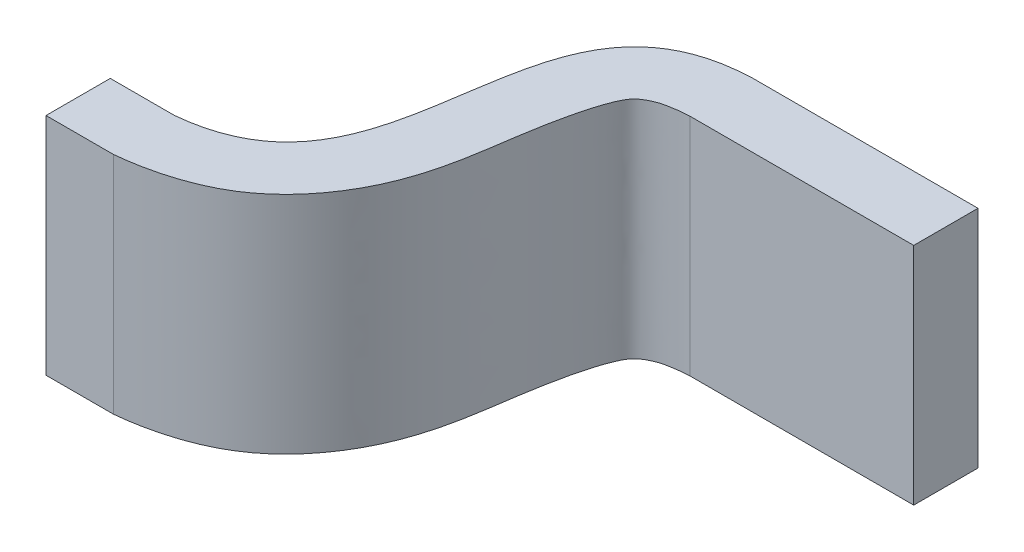
ISO-10303-21;
HEADER;
FILE_DESCRIPTION(('STEP AP214'),'2;1');
FILE_NAME('part.step','',(''),(''),'','','');
FILE_SCHEMA(('AUTOMOTIVE_DESIGN { 1 0 10303 214 1 1 1 1 }'));
ENDSEC;
DATA;
#1=APPLICATION_CONTEXT('core data for automotive mechanical design processes');
#2=APPLICATION_PROTOCOL_DEFINITION('international standard','automotive_design',2000,#1);
#3=PRODUCT_CONTEXT('',#1,'mechanical');
#4=PRODUCT('Part','Part','',(#3));
#5=PRODUCT_RELATED_PRODUCT_CATEGORY('part','',(#4));
#6=PRODUCT_DEFINITION_FORMATION('','',#4);
#7=PRODUCT_DEFINITION_CONTEXT('part definition',#1,'design');
#8=PRODUCT_DEFINITION('design','',#6,#7);
#9=PRODUCT_DEFINITION_SHAPE('','',#8);
#10=(LENGTH_UNIT() NAMED_UNIT(*) SI_UNIT(.MILLI.,.METRE.));
#11=(NAMED_UNIT(*) PLANE_ANGLE_UNIT() SI_UNIT($,.RADIAN.));
#12=(NAMED_UNIT(*) SI_UNIT($,.STERADIAN.) SOLID_ANGLE_UNIT());
#13=UNCERTAINTY_MEASURE_WITH_UNIT(LENGTH_MEASURE(1.E-05),#10,'distance_accuracy_value','');
#14=(GEOMETRIC_REPRESENTATION_CONTEXT(3) GLOBAL_UNCERTAINTY_ASSIGNED_CONTEXT((#13)) GLOBAL_UNIT_ASSIGNED_CONTEXT((#10,
#11,#12)) REPRESENTATION_CONTEXT('',''));
#15=CARTESIAN_POINT('',(0.,0.,0.));
#16=DIRECTION('',(0.,0.,1.));
#17=DIRECTION('',(1.,0.,0.));
#18=AXIS2_PLACEMENT_3D('',#15,#16,#17);
#19=CARTESIAN_POINT('',(0.381062000989914,-1.47687603414217,1.19999994098963));
#20=DIRECTION('',(0.,1.,4.37113882867379E-08));
#21=DIRECTION('',(-1.,0.,0.));
#22=AXIS2_PLACEMENT_3D('',#19,#20,#21);
#23=PLANE('',#22);
#24=DIRECTION('',(1.,0.,0.));
#25=VECTOR('',#24,1.);
#26=CARTESIAN_POINT('',(8.21956578272591,-1.47687599043078,0.199999940989626));
#27=LINE('',#26,#25);
#28=CARTESIAN_POINT('',(8.21956578272591,-1.47687599043078,0.199999940989626));
#29=VERTEX_POINT('',#28);
#30=CARTESIAN_POINT('',(8.91606200098991,-1.47687599043078,0.199999940989626));
#31=VERTEX_POINT('',#30);
#32=EDGE_CURVE('E11',#29,#31,#27,.T.);
#33=ORIENTED_EDGE('',*,*,#32,.F.);
#34=CARTESIAN_POINT('',(8.21956578272591,-1.47687599043078,0.199999940989626));
#35=CARTESIAN_POINT('',(8.21399807265753,-1.47687599044051,0.200222602099352));
#36=CARTESIAN_POINT('',(8.20843683975348,-1.47687599045581,0.200572467057035));
#37=CARTESIAN_POINT('',(8.19732835868844,-1.47687599049638,0.201500599557958));
#38=CARTESIAN_POINT('',(8.19178112714533,-1.47687599052166,0.20207906786945));
#39=CARTESIAN_POINT('',(8.18066889231238,-1.47687599058129,0.203443147589109));
#40=CARTESIAN_POINT('',(8.17510408096633,-1.4768759906157,0.204230319381954));
#41=CARTESIAN_POINT('',(8.16401243640824,-1.47687599069444,0.206031850609965));
#42=CARTESIAN_POINT('',(8.15848559635561,-1.47687599073878,0.20704616795629));
#43=CARTESIAN_POINT('',(8.1465743503038,-1.4768759908516,0.209627265093131));
#44=CARTESIAN_POINT('',(8.14020246940725,-1.4768759909229,0.211258358150453));
#45=CARTESIAN_POINT('',(8.12921644404484,-1.47687599108147,0.214886107390859));
#46=CARTESIAN_POINT('',(8.12454576276441,-1.47687599116087,0.216702585725697));
#47=CARTESIAN_POINT('',(8.11575076349414,-1.47687599133748,0.220742965728565));
#48=CARTESIAN_POINT('',(8.11161057174428,-1.47687599143324,0.222933854437322));
#49=CARTESIAN_POINT('',(8.10253183379761,-1.4768759916593,0.228105114025311));
#50=CARTESIAN_POINT('',(8.09762635625911,-1.47687599179248,0.231151620713566));
#51=CARTESIAN_POINT('',(8.09022405842899,-1.47687599204946,0.237031319573504));
#52=CARTESIAN_POINT('',(8.08749164440591,-1.4768759921597,0.239554011267641));
#53=CARTESIAN_POINT('',(8.08246087272025,-1.47687599239796,0.245002656510496));
#54=CARTESIAN_POINT('',(8.08016330387861,-1.47687599252601,0.247929326572815));
#55=CARTESIAN_POINT('',(8.0759951087917,-1.47687599278959,0.25396046141144));
#56=CARTESIAN_POINT('',(8.07411551519148,-1.47687599292487,0.257058928893297));
#57=CARTESIAN_POINT('',(8.0706064493533,-1.47687599320181,0.263392808416962));
#58=CARTESIAN_POINT('',(8.06897710136162,-1.47687599334349,0.266628287474188));
#59=CARTESIAN_POINT('',(8.06367328775614,-1.4768759938347,0.277849786579691));
#60=CARTESIAN_POINT('',(8.06040085858409,-1.47687599419218,0.286021972777192));
#61=CARTESIAN_POINT('',(8.05218527798451,-1.47687599517134,0.308422084191393));
#62=CARTESIAN_POINT('',(8.04771455008864,-1.47687599579965,0.322813177466201));
#63=CARTESIAN_POINT('',(8.03961753260656,-1.47687599705163,0.35146984270726));
#64=CARTESIAN_POINT('',(8.03597437543715,-1.47687599767508,0.365730846318128));
#65=CARTESIAN_POINT('',(8.02919339350917,-1.47687599892665,0.394362061181507));
#66=CARTESIAN_POINT('',(8.02605527280588,-1.47687599955476,0.40873220327195));
#67=CARTESIAN_POINT('',(8.01736410075411,-1.47687600140841,0.451139464717596));
#68=CARTESIAN_POINT('',(8.01232518312451,-1.47687600263861,0.479282677822178));
#69=CARTESIAN_POINT('',(8.00335647907099,-1.47687600510956,0.535811116286048));
#70=CARTESIAN_POINT('',(7.99942969347175,-1.47687600635033,0.564196787472043));
#71=CARTESIAN_POINT('',(7.99170167000416,-1.4768760086029,0.615729708611764));
#72=CARTESIAN_POINT('',(7.98800715437185,-1.47687600961536,0.638892051638554));
#73=CARTESIAN_POINT('',(7.9794355355205,-1.47687601163106,0.685005751083));
#74=CARTESIAN_POINT('',(7.97455858675596,-1.4768760126343,0.707957134651015));
#75=CARTESIAN_POINT('',(7.96311271686074,-1.47687601461767,0.753331539683628));
#76=CARTESIAN_POINT('',(7.95655194608926,-1.4768760155979,0.775756553644199));
#77=CARTESIAN_POINT('',(7.94136784202336,-1.47687601752719,0.819893592793445));
#78=CARTESIAN_POINT('',(7.93274558328641,-1.47687601847626,0.841605982756187));
#79=CARTESIAN_POINT('',(7.91043792110495,-1.47687602059855,0.890158317257777));
#80=CARTESIAN_POINT('',(7.89600936729223,-1.4768760217571,0.916662583594959));
#81=CARTESIAN_POINT('',(7.86347434987592,-1.47687602397549,0.967413343835515));
#82=CARTESIAN_POINT('',(7.8453597746674,-1.4768760250351,0.991654683188966));
#83=CARTESIAN_POINT('',(7.80790002602411,-1.47687602689358,1.0341715470258));
#84=CARTESIAN_POINT('',(7.78897432705133,-1.47687602770847,1.05281409028392));
#85=CARTESIAN_POINT('',(7.74844565833539,-1.47687602919522,1.08682689740164));
#86=CARTESIAN_POINT('',(7.72685155874366,-1.47687602986752,1.10220756450256));
#87=CARTESIAN_POINT('',(7.68359472899702,-1.47687603098652,1.12780720142861));
#88=CARTESIAN_POINT('',(7.66213857495581,-1.4768760314487,1.13838045617139));
#89=CARTESIAN_POINT('',(7.61806563506122,-1.4768760322593,1.1569248347623));
#90=CARTESIAN_POINT('',(7.59544469766516,-1.47687603260727,1.16488578060009));
#91=CARTESIAN_POINT('',(7.54848495398505,-1.47687603321614,1.17881501865543));
#92=CARTESIAN_POINT('',(7.52411482818412,-1.47687603347234,1.18467606433587));
#93=CARTESIAN_POINT('',(7.47514110847119,-1.47687603388116,1.19402859653764));
#94=CARTESIAN_POINT('',(7.4505414125435,-1.47687603403466,1.19754033118794));
#95=CARTESIAN_POINT('',(7.42586117783791,-1.47687603414216,1.19999994098963));
#96=B_SPLINE_CURVE_WITH_KNOTS('',3,(#34,#35,#36,#37,#38,#39,#40,#41,#42,#43,#44,#45,#46,#47,#48,
#49,#50,#51,#52,#53,#54,#55,#56,#57,#58,#59,#60,#61,#62,#63,#64,#65,#66,#67,#68,#69,#70,#71,#72,
#73,#74,#75,#76,#77,#78,#79,#80,#81,#82,#83,#84,#85,#86,#87,#88,#89,#90,#91,#92,#93,#94,#95),
.UNSPECIFIED.,.F.,.F.,(4,2,2,2,2,2,2,2,2,2,2,2,2,2,2,2,2,2,2,2,2,2,2,2,2,2,2,2,2,2,4),(0.,
0.0167129049826574,0.0334405206169266,0.0502969119078462,0.0671501823813333,0.0868449977925689,
0.101838970321101,0.115885127156847,0.133132127804882,0.144236213112224,0.155360252414285,
0.166215762863007,0.177076645740437,0.203446553112076,0.248618617741089,0.292765096579111,
0.336885611219412,0.422622380023037,0.508588331833532,0.578941414817067,0.649285312924715,
0.719294937731861,0.789268149044623,0.879502218060835,0.969937050040231,1.04934324822106,
1.12849225200604,1.200024637838,1.27183250557101,1.34691026454656,1.42133231106535),.UNSPECIFIED.);
#97=CARTESIAN_POINT('',(7.42586117783791,-1.47687603414217,1.19999994098963));
#98=VERTEX_POINT('',#97);
#99=EDGE_CURVE('E186',#29,#98,#96,.T.);
#100=ORIENTED_EDGE('',*,*,#99,.T.);
#101=DIRECTION('',(1.,0.,0.));
#102=VECTOR('',#101,1.);
#103=CARTESIAN_POINT('',(7.21606200098991,-1.47687603414217,1.19999994098963));
#104=LINE('',#103,#102);
#105=CARTESIAN_POINT('',(7.21606200098991,-1.47687603414217,1.19999994098963));
#106=VERTEX_POINT('',#105);
#107=EDGE_CURVE('E163',#106,#98,#104,.T.);
#108=ORIENTED_EDGE('',*,*,#107,.F.);
#109=DIRECTION('',(0.,4.37113878426487E-08,-0.999999999999999));
#110=VECTOR('',#109,1.);
#111=CARTESIAN_POINT('',(7.21606200098991,-1.47687603414217,1.19999994098963));
#112=LINE('',#111,#110);
#113=CARTESIAN_POINT('',(7.21606200098991,-1.47687602539989,0.999999940989626));
#114=VERTEX_POINT('',#113);
#115=EDGE_CURVE('E155',#106,#114,#112,.T.);
#116=ORIENTED_EDGE('',*,*,#115,.T.);
#117=DIRECTION('',(-1.,0.,0.));
#118=VECTOR('',#117,1.);
#119=CARTESIAN_POINT('',(7.41606200098991,-1.47687602539989,0.999999940989626));
#120=LINE('',#119,#118);
#121=CARTESIAN_POINT('',(7.41606200098991,-1.47687602539989,0.999999940989626));
#122=VERTEX_POINT('',#121);
#123=EDGE_CURVE('E148',#122,#114,#120,.T.);
#124=ORIENTED_EDGE('',*,*,#123,.F.);
#125=CARTESIAN_POINT('',(8.21606200098991,-1.4768759816885,-5.90103741720499E-08));
#126=CARTESIAN_POINT('',(8.19358510313693,-1.47687598172138,0.000751885623027959));
#127=CARTESIAN_POINT('',(8.17100793476501,-1.47687598179905,0.00252883893298747));
#128=CARTESIAN_POINT('',(8.12597309478915,-1.4768759820813,0.00898622538832351));
#129=CARTESIAN_POINT('',(8.10352138339691,-1.47687598228763,0.0137064325656295));
#130=CARTESIAN_POINT('',(8.06515365819845,-1.47687598279382,0.0252868334657557));
#131=CARTESIAN_POINT('',(8.04899929251523,-1.47687598305774,0.0313244122267527));
#132=CARTESIAN_POINT('',(8.01789140683102,-1.47687598369121,0.0458164456425912));
#133=CARTESIAN_POINT('',(8.00293202850773,-1.4768759840602,0.0542580473634458));
#134=CARTESIAN_POINT('',(7.97580927414815,-1.47687598487283,0.0728488263759816));
#135=CARTESIAN_POINT('',(7.96351851659414,-1.47687598530831,0.082811402294966));
#136=CARTESIAN_POINT('',(7.94069381725784,-1.47687598626057,0.104596546543675));
#137=CARTESIAN_POINT('',(7.93016206041085,-1.47687598677745,0.11642139319658));
#138=CARTESIAN_POINT('',(7.90934268339576,-1.47687598796568,0.143604990461998));
#139=CARTESIAN_POINT('',(7.89939730340264,-1.47687598864838,0.159223219035321));
#140=CARTESIAN_POINT('',(7.8817786902267,-1.47687599006819,0.191704849783171));
#141=CARTESIAN_POINT('',(7.87411125124448,-1.47687599080544,0.20857129324181));
#142=CARTESIAN_POINT('',(7.85831224281672,-1.47687599256403,0.248803257681499));
#143=CARTESIAN_POINT('',(7.85089650929935,-1.47687599359732,0.272441945859289));
#144=CARTESIAN_POINT('',(7.83819654268846,-1.47687599568625,0.320230952552112));
#145=CARTESIAN_POINT('',(7.83291120075709,-1.47687599674187,0.344380998005618));
#146=CARTESIAN_POINT('',(7.82019523572656,-1.47687599961588,0.410130867006334));
#147=CARTESIAN_POINT('',(7.81390954748545,-1.47687600144318,0.451934227237508));
#148=CARTESIAN_POINT('',(7.80123041061269,-1.47687600510757,0.535765753860261));
#149=CARTESIAN_POINT('',(7.79483655698354,-1.47687600694467,0.577793876847088));
#150=CARTESIAN_POINT('',(7.78272745030488,-1.47687600963624,0.639369673752824));
#151=CARTESIAN_POINT('',(7.77840818033405,-1.47687601050181,0.659171608041226));
#152=CARTESIAN_POINT('',(7.76846333575577,-1.47687601221967,0.698471663366859));
#153=CARTESIAN_POINT('',(7.76283677771603,-1.47687601307195,0.717969543831356));
#154=CARTESIAN_POINT('',(7.74980357127117,-1.4768760147411,0.756155189820319));
#155=CARTESIAN_POINT('',(7.74241624835149,-1.47687601555825,0.774849314908153));
#156=CARTESIAN_POINT('',(7.72528765923403,-1.47687601714307,0.811105873354096));
#157=CARTESIAN_POINT('',(7.71555219177743,-1.47687601791086,0.828670961591232));
#158=CARTESIAN_POINT('',(7.69291712212291,-1.4768760193913,0.862539441280771));
#159=CARTESIAN_POINT('',(7.67992280719315,-1.47687602010125,0.878781202559514));
#160=CARTESIAN_POINT('',(7.6509915949129,-1.47687602139555,0.90839130129333));
#161=CARTESIAN_POINT('',(7.63505740825526,-1.47687602198001,0.921762261379834));
#162=CARTESIAN_POINT('',(7.60251216289671,-1.47687602295392,0.944042754430359));
#163=CARTESIAN_POINT('',(7.58610329850445,-1.47687602335649,0.953252327062622));
#164=CARTESIAN_POINT('',(7.55200247896581,-1.47687602404617,0.96903035362042));
#165=CARTESIAN_POINT('',(7.53430550805647,-1.47687602433279,0.975587750967198));
#166=CARTESIAN_POINT('',(7.49987529020758,-1.47687602478264,0.985879039904428));
#167=CARTESIAN_POINT('',(7.48319962545166,-1.47687602495468,0.989814647153144));
#168=CARTESIAN_POINT('',(7.44971156339336,-1.47687602522663,0.99603614183989));
#169=CARTESIAN_POINT('',(7.43290223265527,-1.47687602532726,0.99833823845773));
#170=CARTESIAN_POINT('',(7.41606200098991,-1.47687602539989,0.999999940989626));
#171=B_SPLINE_CURVE_WITH_KNOTS('',3,(#125,#126,#127,#128,#129,#130,#131,#132,#133,#134,#135,
#136,#137,#138,#139,#140,#141,#142,#143,#144,#145,#146,#147,#148,#149,#150,#151,#152,#153,#154,
#155,#156,#157,#158,#159,#160,#161,#162,#163,#164,#165,#166,#167,#168,#169,#170),.UNSPECIFIED.,
.F.,.F.,(4,2,2,2,2,2,2,2,2,2,2,2,2,2,2,2,2,2,2,2,2,2,4),(0.,0.0676605368254322,
0.136255841823736,0.187815232472042,0.239103979458815,0.28635747593516,0.333669238509404,
0.388978971846571,0.44442821035716,0.518581097757563,0.592695339665636,0.719482422739694,
0.84697498806058,0.907746805484856,0.968564488536605,1.02874313069962,1.08877465652057,
1.15080863583323,1.21278570033354,1.2689745883637,1.32539536427915,1.3767136749948,
1.42751535438906),.UNSPECIFIED.);
#172=CARTESIAN_POINT('',(8.21606200098991,-1.4768759816885,-5.90103741870962E-08));
#173=VERTEX_POINT('',#172);
#174=EDGE_CURVE('E99',#173,#122,#171,.T.);
#175=ORIENTED_EDGE('',*,*,#174,.F.);
#176=DIRECTION('',(1.,0.,0.));
#177=VECTOR('',#176,1.);
#178=CARTESIAN_POINT('',(8.21606200098991,-1.4768759816885,-5.90103741870963E-08));
#179=LINE('',#178,#177);
#180=CARTESIAN_POINT('',(8.91606200098991,-1.4768759816885,-5.90103741870962E-08));
#181=VERTEX_POINT('',#180);
#182=EDGE_CURVE('E93',#173,#181,#179,.T.);
#183=ORIENTED_EDGE('',*,*,#182,.T.);
#184=DIRECTION('',(0.,4.37113878426487E-08,-0.999999999999999));
#185=VECTOR('',#184,1.);
#186=CARTESIAN_POINT('',(8.91606200098991,-1.47687599043078,0.199999940989626));
#187=LINE('',#186,#185);
#188=EDGE_CURVE('E194',#31,#181,#187,.T.);
#189=ORIENTED_EDGE('',*,*,#188,.F.);
#190=EDGE_LOOP('',(#33,#100,#108,#116,#124,#175,#183,#189));
#191=FACE_BOUND('',#190,.T.);
#192=ADVANCED_FACE('F17',(#191),#23,.F.);
#193=CARTESIAN_POINT('',(8.91606200098991,-0.126876034142165,1.2));
#194=DIRECTION('',(-1.,0.,0.));
#195=DIRECTION('',(0.,-1.,-4.37113882867379E-08));
#196=AXIS2_PLACEMENT_3D('',#193,#194,#195);
#197=PLANE('',#196);
#198=DIRECTION('',(0.,-0.999999999999999,-4.37113883184584E-08));
#199=VECTOR('',#198,1.);
#200=CARTESIAN_POINT('',(8.91606200098991,-0.776875990430776,0.199999971587598));
#201=LINE('',#200,#199);
#202=CARTESIAN_POINT('',(8.91606200098991,-0.776875990430777,0.199999971587598));
#203=VERTEX_POINT('',#202);
#204=EDGE_CURVE('E25',#203,#31,#201,.T.);
#205=ORIENTED_EDGE('',*,*,#204,.T.);
#206=ORIENTED_EDGE('',*,*,#188,.T.);
#207=DIRECTION('',(0.,0.999999999999999,4.37113882867379E-08));
#208=VECTOR('',#207,1.);
#209=CARTESIAN_POINT('',(8.91606200098991,-1.4768759816885,-5.90103741870962E-08));
#210=LINE('',#209,#208);
#211=CARTESIAN_POINT('',(8.91606200098991,-0.776875981688499,-2.84124023863797E-08));
#212=VERTEX_POINT('',#211);
#213=EDGE_CURVE('E157',#181,#212,#210,.T.);
#214=ORIENTED_EDGE('',*,*,#213,.T.);
#215=DIRECTION('',(0.,4.37113883977602E-08,-0.999999999999999));
#216=VECTOR('',#215,1.);
#217=CARTESIAN_POINT('',(8.91606200098991,-0.776875990430777,0.199999971587598));
#218=LINE('',#217,#216);
#219=EDGE_CURVE('E150',#203,#212,#218,.T.);
#220=ORIENTED_EDGE('',*,*,#219,.F.);
#221=EDGE_LOOP('',(#205,#206,#214,#220));
#222=FACE_BOUND('',#221,.T.);
#223=ADVANCED_FACE('F205',(#222),#197,.F.);
#224=CARTESIAN_POINT('',(0.381062000989914,-0.776876034142165,1.1999999715876));
#225=DIRECTION('',(0.,1.,4.37113882867379E-08));
#226=DIRECTION('',(-1.,0.,0.));
#227=AXIS2_PLACEMENT_3D('',#224,#225,#226);
#228=PLANE('',#227);
#229=CARTESIAN_POINT('',(8.21956578272591,-0.776875990430779,0.199999971587598));
#230=CARTESIAN_POINT('',(8.21399807265753,-0.776875990440512,0.200222632697324));
#231=CARTESIAN_POINT('',(8.20843683975348,-0.776875990455805,0.200572497655007));
#232=CARTESIAN_POINT('',(8.19732835868844,-0.776875990496374,0.20150063015593));
#233=CARTESIAN_POINT('',(8.19178112714533,-0.77687599052166,0.202079098467422));
#234=CARTESIAN_POINT('',(8.18066889231238,-0.776875990581286,0.20344317818708));
#235=CARTESIAN_POINT('',(8.17510408096633,-0.776875990615695,0.204230349979926));
#236=CARTESIAN_POINT('',(8.16401243640824,-0.776875990694441,0.206031881207937));
#237=CARTESIAN_POINT('',(8.15848559635561,-0.776875990738777,0.207046198554262));
#238=CARTESIAN_POINT('',(8.1465743503038,-0.776875990851605,0.209627295691103));
#239=CARTESIAN_POINT('',(8.14020246940725,-0.776875990922911,0.211258388748425));
#240=CARTESIAN_POINT('',(8.12921644404484,-0.776875991081463,0.214886137988831));
#241=CARTESIAN_POINT('',(8.12454576276441,-0.776875991160842,0.216702616323669));
#242=CARTESIAN_POINT('',(8.11575076349414,-0.776875991337514,0.220742996326537));
#243=CARTESIAN_POINT('',(8.11161057174428,-0.776875991433356,0.222933885035294));
#244=CARTESIAN_POINT('',(8.10253183379761,-0.776875991659151,0.228105144623283));
#245=CARTESIAN_POINT('',(8.09762635625911,-0.7768759917919,0.231151651311537));
#246=CARTESIAN_POINT('',(8.09022405842899,-0.776875992049665,0.237031350171476));
#247=CARTESIAN_POINT('',(8.08749164440591,-0.776875992160595,0.239554041865613));
#248=CARTESIAN_POINT('',(8.08246087272025,-0.776875992397055,0.245002687108469));
#249=CARTESIAN_POINT('',(8.08016330387861,-0.77687599252261,0.247929357170787));
#250=CARTESIAN_POINT('',(8.0759951087917,-0.776875992787111,0.253960492009412));
#251=CARTESIAN_POINT('',(8.07411551519148,-0.77687599292566,0.25705895949127));
#252=CARTESIAN_POINT('',(8.0706064493533,-0.776875993201015,0.263392839014934));
#253=CARTESIAN_POINT('',(8.06897710136162,-0.776875993337821,0.26662831807216));
#254=CARTESIAN_POINT('',(8.06367328775614,-0.776875993815115,0.277849817177661));
#255=CARTESIAN_POINT('',(8.06040085858409,-0.776875994167495,0.286022003375163));
#256=CARTESIAN_POINT('',(8.05218527798451,-0.77687599514636,0.308422114789365));
#257=CARTESIAN_POINT('',(8.04771455008865,-0.776875995789141,0.322813208064172));
#258=CARTESIAN_POINT('',(8.03961753260656,-0.776875997053713,0.351469873305231));
#259=CARTESIAN_POINT('',(8.03597437543715,-0.77687599767565,0.365730876916098));
#260=CARTESIAN_POINT('',(8.02919339350918,-0.776875998926074,0.394362091779477));
#261=CARTESIAN_POINT('',(8.02605527280588,-0.776875999554557,0.408732233869921));
#262=CARTESIAN_POINT('',(8.01736410075412,-0.776876001408778,0.451139495315569));
#263=CARTESIAN_POINT('',(8.01232518312452,-0.776876002638707,0.479282708420148));
#264=CARTESIAN_POINT('',(8.00335647907098,-0.776876005109459,0.535811146884017));
#265=CARTESIAN_POINT('',(7.99942969347175,-0.776876006350302,0.564196818070013));
#266=CARTESIAN_POINT('',(7.99170167000416,-0.776876008602918,0.615729739209734));
#267=CARTESIAN_POINT('',(7.98800715437185,-0.776876009615366,0.638892082236523));
#268=CARTESIAN_POINT('',(7.9794355355205,-0.776876011631052,0.68500578168097));
#269=CARTESIAN_POINT('',(7.97455858675596,-0.776876012634292,0.707957165248984));
#270=CARTESIAN_POINT('',(7.96311271686074,-0.776876014617672,0.753331570281596));
#271=CARTESIAN_POINT('',(7.95655194608926,-0.7768760155979,0.775756584242166));
#272=CARTESIAN_POINT('',(7.94136784202336,-0.77687601752719,0.819893623391413));
#273=CARTESIAN_POINT('',(7.93274558328642,-0.776876018476268,0.841606013354157));
#274=CARTESIAN_POINT('',(7.91043792110496,-0.776876020598557,0.890158347855748));
#275=CARTESIAN_POINT('',(7.89600936729224,-0.776876021757097,0.916662614192927));
#276=CARTESIAN_POINT('',(7.86347434987592,-0.776876023975484,0.967413374433482));
#277=CARTESIAN_POINT('',(7.8453597746674,-0.776876025035106,0.991654713786933));
#278=CARTESIAN_POINT('',(7.80790002602411,-0.776876026893577,1.03417157762377));
#279=CARTESIAN_POINT('',(7.78897432705133,-0.776876027708469,1.05281412088189));
#280=CARTESIAN_POINT('',(7.74844565833539,-0.776876029195216,1.08682692799962));
#281=CARTESIAN_POINT('',(7.72685155874366,-0.776876029867526,1.10220759510053));
#282=CARTESIAN_POINT('',(7.68359472899701,-0.776876030986521,1.12780723202658));
#283=CARTESIAN_POINT('',(7.66213857495581,-0.776876031448693,1.13838048676936));
#284=CARTESIAN_POINT('',(7.61806563506123,-0.776876032259295,1.15692486536028));
#285=CARTESIAN_POINT('',(7.59544469766516,-0.776876032607279,1.16488581119806));
#286=CARTESIAN_POINT('',(7.54848495398505,-0.776876033216145,1.1788150492534));
#287=CARTESIAN_POINT('',(7.52411482818412,-0.776876033472339,1.18467609493384));
#288=CARTESIAN_POINT('',(7.47514110847119,-0.776876033881151,1.19402862713561));
#289=CARTESIAN_POINT('',(7.4505414125435,-0.776876034034653,1.19754036178591));
#290=CARTESIAN_POINT('',(7.42586117783791,-0.776876034142166,1.1999999715876));
#291=B_SPLINE_CURVE_WITH_KNOTS('',3,(#229,#230,#231,#232,#233,#234,#235,#236,#237,#238,#239,
#240,#241,#242,#243,#244,#245,#246,#247,#248,#249,#250,#251,#252,#253,#254,#255,#256,#257,#258,
#259,#260,#261,#262,#263,#264,#265,#266,#267,#268,#269,#270,#271,#272,#273,#274,#275,#276,#277,
#278,#279,#280,#281,#282,#283,#284,#285,#286,#287,#288,#289,#290),.UNSPECIFIED.,.F.,.F.,(4,2,2,
2,2,2,2,2,2,2,2,2,2,2,2,2,2,2,2,2,2,2,2,2,2,2,2,2,2,2,4),(0.,0.0167129049826574,
0.0334405206169266,0.0502969119078462,0.0671501823813334,0.0868449977925689,0.101838970321101,
0.115885127156847,0.133132127804882,0.144236213112224,0.155360252414285,0.166215762863006,
0.177076645740436,0.203446553112074,0.248618617741088,0.292765096579109,0.336885611219408,
0.422622380023034,0.508588331833529,0.578941414817064,0.649285312924711,0.719294937731856,
0.789268149044616,0.879502218060829,0.969937050040229,1.04934324822106,1.12849225200604,
1.200024637838,1.27183250557101,1.34691026454656,1.42133231106535),.UNSPECIFIED.);
#292=CARTESIAN_POINT('',(8.21956578272591,-0.776875990430777,0.199999971587598));
#293=VERTEX_POINT('',#292);
#294=CARTESIAN_POINT('',(7.42586117783791,-0.776876034142165,1.1999999715876));
#295=VERTEX_POINT('',#294);
#296=EDGE_CURVE('E180',#293,#295,#291,.T.);
#297=ORIENTED_EDGE('',*,*,#296,.F.);
#298=DIRECTION('',(1.,0.,0.));
#299=VECTOR('',#298,1.);
#300=CARTESIAN_POINT('',(8.21956578272591,-0.776875990430779,0.199999971587597));
#301=LINE('',#300,#299);
#302=EDGE_CURVE('E159',#293,#203,#301,.T.);
#303=ORIENTED_EDGE('',*,*,#302,.T.);
#304=ORIENTED_EDGE('',*,*,#219,.T.);
#305=DIRECTION('',(1.,0.,0.));
#306=VECTOR('',#305,1.);
#307=CARTESIAN_POINT('',(8.21606200098991,-0.776875981688502,-2.84124023863797E-08));
#308=LINE('',#307,#306);
#309=CARTESIAN_POINT('',(8.21606200098991,-0.776875981688499,-2.84124023863797E-08));
#310=VERTEX_POINT('',#309);
#311=EDGE_CURVE('E89',#310,#212,#308,.T.);
#312=ORIENTED_EDGE('',*,*,#311,.F.);
#313=CARTESIAN_POINT('',(8.21606200098991,-0.776875981688501,-2.84124024085841E-08));
#314=CARTESIAN_POINT('',(8.19358510313693,-0.77687598172137,0.000751916221000052));
#315=CARTESIAN_POINT('',(8.17100793476501,-0.776875981799043,0.00252886953095956));
#316=CARTESIAN_POINT('',(8.12597309478915,-0.776875982081304,0.00898625598629538));
#317=CARTESIAN_POINT('',(8.10352138339691,-0.77687598228763,0.0137064631636012));
#318=CARTESIAN_POINT('',(8.06515365819845,-0.776875982793826,0.0252868640637273));
#319=CARTESIAN_POINT('',(8.04899929251523,-0.776875983057737,0.0313244428247243));
#320=CARTESIAN_POINT('',(8.01789140683102,-0.776875983691204,0.045816476240563));
#321=CARTESIAN_POINT('',(8.00293202850773,-0.776875984060198,0.0542580779614177));
#322=CARTESIAN_POINT('',(7.97580927414815,-0.776875984872827,0.0728488569739535));
#323=CARTESIAN_POINT('',(7.96351851659414,-0.776875985308305,0.0828114328929379));
#324=CARTESIAN_POINT('',(7.94069381725784,-0.776875986260564,0.104596577141647));
#325=CARTESIAN_POINT('',(7.93016206041085,-0.776875986777445,0.116421423794552));
#326=CARTESIAN_POINT('',(7.90934268339576,-0.776875987965678,0.14360502105997));
#327=CARTESIAN_POINT('',(7.89939730340264,-0.776875988648372,0.159223249633294));
#328=CARTESIAN_POINT('',(7.8817786902267,-0.776875990068188,0.191704880381143));
#329=CARTESIAN_POINT('',(7.87411125124448,-0.776875990805444,0.208571323839782));
#330=CARTESIAN_POINT('',(7.85831224281672,-0.776875992564039,0.248803288279471));
#331=CARTESIAN_POINT('',(7.85089650929935,-0.776875993597319,0.272441976457261));
#332=CARTESIAN_POINT('',(7.83819654268846,-0.776875995686243,0.320230983150084));
#333=CARTESIAN_POINT('',(7.83291120075709,-0.776875996741875,0.34438102860359));
#334=CARTESIAN_POINT('',(7.82019523572656,-0.776875999615893,0.410130897604306));
#335=CARTESIAN_POINT('',(7.81390954748545,-0.776876001443176,0.45193425783548));
#336=CARTESIAN_POINT('',(7.80123041061268,-0.776876005107569,0.535765784458232));
#337=CARTESIAN_POINT('',(7.79483655698354,-0.776876006944676,0.57779390744506));
#338=CARTESIAN_POINT('',(7.78272745030488,-0.77687600963624,0.639369704350796));
#339=CARTESIAN_POINT('',(7.77840818033406,-0.77687601050181,0.659171638639199));
#340=CARTESIAN_POINT('',(7.76846333575577,-0.77687601221967,0.698471693964831));
#341=CARTESIAN_POINT('',(7.76283677771603,-0.776876013071949,0.717969574429328));
#342=CARTESIAN_POINT('',(7.74980357127116,-0.776876014741097,0.756155220418291));
#343=CARTESIAN_POINT('',(7.74241624835149,-0.776876015558243,0.774849345506125));
#344=CARTESIAN_POINT('',(7.72528765923403,-0.776876017143067,0.811105903952068));
#345=CARTESIAN_POINT('',(7.71555219177743,-0.776876017910861,0.828670992189204));
#346=CARTESIAN_POINT('',(7.69291712212291,-0.776876019391299,0.862539471878743));
#347=CARTESIAN_POINT('',(7.67992280719315,-0.77687602010125,0.878781233157486));
#348=CARTESIAN_POINT('',(7.6509915949129,-0.776876021395549,0.908391331891301));
#349=CARTESIAN_POINT('',(7.63505740825526,-0.776876021980012,0.921762291977805));
#350=CARTESIAN_POINT('',(7.60251216289671,-0.776876022953923,0.94404278502833));
#351=CARTESIAN_POINT('',(7.58610329850445,-0.776876023356486,0.953252357660594));
#352=CARTESIAN_POINT('',(7.55200247896581,-0.776876024046166,0.969030384218392));
#353=CARTESIAN_POINT('',(7.53430550805647,-0.776876024332798,0.975587781565169));
#354=CARTESIAN_POINT('',(7.49987529020758,-0.776876024782645,0.985879070502399));
#355=CARTESIAN_POINT('',(7.48319962545166,-0.776876024954676,0.989814677751116));
#356=CARTESIAN_POINT('',(7.44971156339336,-0.776876025226626,0.996036172437862));
#357=CARTESIAN_POINT('',(7.43290223265527,-0.776876025327254,0.998338269055703));
#358=CARTESIAN_POINT('',(7.41606200098991,-0.776876025399889,0.999999971587598));
#359=B_SPLINE_CURVE_WITH_KNOTS('',3,(#313,#314,#315,#316,#317,#318,#319,#320,#321,#322,#323,
#324,#325,#326,#327,#328,#329,#330,#331,#332,#333,#334,#335,#336,#337,#338,#339,#340,#341,#342,
#343,#344,#345,#346,#347,#348,#349,#350,#351,#352,#353,#354,#355,#356,#357,#358),.UNSPECIFIED.,
.F.,.F.,(4,2,2,2,2,2,2,2,2,2,2,2,2,2,2,2,2,2,2,2,2,2,4),(0.,0.0676605368254323,
0.136255841823736,0.187815232472042,0.239103979458816,0.28635747593516,0.333669238509405,
0.388978971846571,0.44442821035716,0.518581097757563,0.592695339665636,0.719482422739694,
0.84697498806058,0.907746805484856,0.968564488536605,1.02874313069962,1.08877465652057,
1.15080863583323,1.21278570033354,1.2689745883637,1.32539536427915,1.3767136749948,
1.42751535438906),.UNSPECIFIED.);
#360=CARTESIAN_POINT('',(7.41606200098991,-0.776876025399888,0.999999971587598));
#361=VERTEX_POINT('',#360);
#362=EDGE_CURVE('E81',#310,#361,#359,.T.);
#363=ORIENTED_EDGE('',*,*,#362,.T.);
#364=DIRECTION('',(-1.,0.,0.));
#365=VECTOR('',#364,1.);
#366=CARTESIAN_POINT('',(7.41606200098991,-0.77687602539989,0.999999971587598));
#367=LINE('',#366,#365);
#368=CARTESIAN_POINT('',(7.21606200098991,-0.776876025399888,0.999999971587598));
#369=VERTEX_POINT('',#368);
#370=EDGE_CURVE('E86',#361,#369,#367,.T.);
#371=ORIENTED_EDGE('',*,*,#370,.T.);
#372=DIRECTION('',(0.,4.37113883977602E-08,-0.999999999999999));
#373=VECTOR('',#372,1.);
#374=CARTESIAN_POINT('',(7.21606200098991,-0.776876034142165,1.1999999715876));
#375=LINE('',#374,#373);
#376=CARTESIAN_POINT('',(7.21606200098991,-0.776876034142165,1.1999999715876));
#377=VERTEX_POINT('',#376);
#378=EDGE_CURVE('E161',#377,#369,#375,.T.);
#379=ORIENTED_EDGE('',*,*,#378,.F.);
#380=DIRECTION('',(1.,0.,0.));
#381=VECTOR('',#380,1.);
#382=CARTESIAN_POINT('',(7.21606200098991,-0.776876034142167,1.1999999715876));
#383=LINE('',#382,#381);
#384=EDGE_CURVE('E208',#377,#295,#383,.T.);
#385=ORIENTED_EDGE('',*,*,#384,.T.);
#386=EDGE_LOOP('',(#297,#303,#304,#312,#363,#371,#379,#385));
#387=FACE_BOUND('',#386,.T.);
#388=ADVANCED_FACE('F83',(#387),#228,.T.);
#389=CARTESIAN_POINT('',(7.21606200098991,-0.126876034142165,1.2));
#390=DIRECTION('',(-1.,0.,0.));
#391=DIRECTION('',(0.,-1.,-4.37113882867379E-08));
#392=AXIS2_PLACEMENT_3D('',#389,#390,#391);
#393=PLANE('',#392);
#394=ORIENTED_EDGE('',*,*,#378,.T.);
#395=DIRECTION('',(0.,-0.999999999999999,-4.37113881598551E-08));
#396=VECTOR('',#395,1.);
#397=CARTESIAN_POINT('',(7.21606200098992,-0.776876025399886,0.999999971587598));
#398=LINE('',#397,#396);
#399=EDGE_CURVE('E107',#369,#114,#398,.T.);
#400=ORIENTED_EDGE('',*,*,#399,.T.);
#401=ORIENTED_EDGE('',*,*,#115,.F.);
#402=DIRECTION('',(0.,0.999999999999999,4.37113881598553E-08));
#403=VECTOR('',#402,1.);
#404=CARTESIAN_POINT('',(7.21606200098991,-1.47687603414217,1.19999994098963));
#405=LINE('',#404,#403);
#406=EDGE_CURVE('E92',#106,#377,#405,.T.);
#407=ORIENTED_EDGE('',*,*,#406,.T.);
#408=EDGE_LOOP('',(#394,#400,#401,#407));
#409=FACE_BOUND('',#408,.T.);
#410=ADVANCED_FACE('F177',(#409),#393,.T.);
#411=CARTESIAN_POINT('',(0.381062000989914,-0.126875981688499,0.));
#412=DIRECTION('',(0.,-4.37113882867379E-08,1.));
#413=DIRECTION('',(0.,-1.,-4.37113882867379E-08));
#414=AXIS2_PLACEMENT_3D('',#411,#412,#413);
#415=PLANE('',#414);
#416=DIRECTION('',(0.,-0.999999999999999,-4.37113882867379E-08));
#417=VECTOR('',#416,1.);
#418=CARTESIAN_POINT('',(8.21606200098991,-0.776875981688499,-2.84124023863797E-08));
#419=LINE('',#418,#417);
#420=EDGE_CURVE('E153',#310,#173,#419,.T.);
#421=ORIENTED_EDGE('',*,*,#420,.F.);
#422=ORIENTED_EDGE('',*,*,#311,.T.);
#423=ORIENTED_EDGE('',*,*,#213,.F.);
#424=ORIENTED_EDGE('',*,*,#182,.F.);
#425=EDGE_LOOP('',(#421,#422,#423,#424));
#426=FACE_BOUND('',#425,.T.);
#427=ADVANCED_FACE('F129',(#426),#415,.F.);
#428=CARTESIAN_POINT('',(0.381062000989914,-0.126876034142165,1.2));
#429=DIRECTION('',(0.,-4.37113882867379E-08,1.));
#430=DIRECTION('',(0.,-1.,-4.37113882867379E-08));
#431=AXIS2_PLACEMENT_3D('',#428,#429,#430);
#432=PLANE('',#431);
#433=DIRECTION('',(0.,-0.999999999999999,-4.37113881598553E-08));
#434=VECTOR('',#433,1.);
#435=CARTESIAN_POINT('',(7.42586117783791,-0.776876034142165,1.1999999715876));
#436=LINE('',#435,#434);
#437=EDGE_CURVE('E145',#295,#98,#436,.T.);
#438=ORIENTED_EDGE('',*,*,#437,.F.);
#439=ORIENTED_EDGE('',*,*,#384,.F.);
#440=ORIENTED_EDGE('',*,*,#406,.F.);
#441=ORIENTED_EDGE('',*,*,#107,.T.);
#442=EDGE_LOOP('',(#438,#439,#440,#441));
#443=FACE_BOUND('',#442,.T.);
#444=ADVANCED_FACE('F199',(#443),#432,.T.);
#445=CARTESIAN_POINT('',(0.381062000989914,5.01775443609411,1.00000022487894));
#446=DIRECTION('',(0.,4.37113882867379E-08,-1.));
#447=DIRECTION('',(0.,1.,4.37113882867379E-08));
#448=AXIS2_PLACEMENT_3D('',#445,#446,#447);
#449=PLANE('',#448);
#450=ORIENTED_EDGE('',*,*,#123,.T.);
#451=ORIENTED_EDGE('',*,*,#399,.F.);
#452=ORIENTED_EDGE('',*,*,#370,.F.);
#453=DIRECTION('',(0.,-0.999999999999999,-4.37113881598551E-08));
#454=VECTOR('',#453,1.);
#455=CARTESIAN_POINT('',(7.41606200098991,-0.776876025399886,0.999999971587598));
#456=LINE('',#455,#454);
#457=EDGE_CURVE('E97',#361,#122,#456,.T.);
#458=ORIENTED_EDGE('',*,*,#457,.T.);
#459=EDGE_LOOP('',(#450,#451,#452,#458));
#460=FACE_BOUND('',#459,.T.);
#461=ADVANCED_FACE('F105',(#460),#449,.T.);
#462=CARTESIAN_POINT('',(7.41606200098991,5.01775443609411,1.00000022487894));
#463=CARTESIAN_POINT('',(8.06137939913391,5.01775443886489,0.93661226287194));
#464=CARTESIAN_POINT('',(7.55196529161691,5.01775447886606,0.0214920441178097));
#465=CARTESIAN_POINT('',(8.21606200098991,5.0177544798055,2.24878939694144E-07));
#466=B_SPLINE_CURVE_WITH_KNOTS('',3,(#462,#463,#464,#465),.UNSPECIFIED.,.F.,.F.,(4,4),(0.,1.),.UNSPECIFIED.);
#467=DIRECTION('',(0.,-0.999999999999999,-4.37113882867379E-08));
#468=VECTOR('',#467,1.);
#469=SURFACE_OF_LINEAR_EXTRUSION('',#466,#468);
#470=ORIENTED_EDGE('',*,*,#174,.T.);
#471=ORIENTED_EDGE('',*,*,#457,.F.);
#472=ORIENTED_EDGE('',*,*,#362,.F.);
#473=ORIENTED_EDGE('',*,*,#420,.T.);
#474=EDGE_LOOP('',(#470,#471,#472,#473));
#475=FACE_BOUND('',#474,.T.);
#476=ADVANCED_FACE('F98',(#475),#469,.T.);
#477=CARTESIAN_POINT('',(0.381062000989914,5.01775447106322,0.20000022487894));
#478=DIRECTION('',(0.,-4.37113882867379E-08,1.));
#479=DIRECTION('',(-1.,0.,0.));
#480=AXIS2_PLACEMENT_3D('',#477,#478,#479);
#481=PLANE('',#480);
#482=ORIENTED_EDGE('',*,*,#32,.T.);
#483=ORIENTED_EDGE('',*,*,#204,.F.);
#484=ORIENTED_EDGE('',*,*,#302,.F.);
#485=DIRECTION('',(0.,-0.999999999999999,-4.37113883184584E-08));
#486=VECTOR('',#485,1.);
#487=CARTESIAN_POINT('',(8.21956578272591,-0.776875990430776,0.199999971587598));
#488=LINE('',#487,#486);
#489=EDGE_CURVE('E102',#293,#29,#488,.T.);
#490=ORIENTED_EDGE('',*,*,#489,.T.);
#491=EDGE_LOOP('',(#482,#483,#484,#490));
#492=FACE_BOUND('',#491,.T.);
#493=ADVANCED_FACE('F128',(#492),#481,.T.);
#494=CARTESIAN_POINT('',(7.42586117783791,5.01775442735183,1.20000022487894));
#495=CARTESIAN_POINT('',(7.52323557934491,5.01775442776993,1.19043537372094));
#496=CARTESIAN_POINT('',(7.72758399467491,5.01775443018266,1.13523848292794));
#497=CARTESIAN_POINT('',(7.96817675723591,5.01775444236442,0.85655227210794));
#498=CARTESIAN_POINT('',(8.00047382700591,5.01775445822105,0.49379478761794));
#499=CARTESIAN_POINT('',(8.06032189164391,5.01775446848464,0.25899132482694));
#500=CARTESIAN_POINT('',(8.09817849874591,5.0177544697967,0.22897490490494));
#501=CARTESIAN_POINT('',(8.14111952633391,5.01775447070118,0.20828275194794));
#502=CARTESIAN_POINT('',(8.19602789838591,5.01775447102387,0.20090043049794));
#503=CARTESIAN_POINT('',(8.21956578272591,5.01775447106322,0.20000022487894));
#504=B_SPLINE_CURVE_WITH_KNOTS('',3,(#494,#495,#496,#497,#498,#499,#500,#501,#502,#503),
.UNSPECIFIED.,.F.,.F.,(4,1,1,1,1,1,1,4),(-0.005037439357121,0.120331553469,0.245700546295,
0.496438531947,0.747176517599,0.872545510425,0.935230006838,0.997914503251),.UNSPECIFIED.);
#505=DIRECTION('',(0.,-0.999999999999999,-4.37113882867379E-08));
#506=VECTOR('',#505,1.);
#507=SURFACE_OF_LINEAR_EXTRUSION('',#504,#506);
#508=ORIENTED_EDGE('',*,*,#489,.F.);
#509=ORIENTED_EDGE('',*,*,#296,.T.);
#510=ORIENTED_EDGE('',*,*,#437,.T.);
#511=ORIENTED_EDGE('',*,*,#99,.F.);
#512=EDGE_LOOP('',(#508,#509,#510,#511));
#513=FACE_BOUND('',#512,.T.);
#514=ADVANCED_FACE('F172',(#513),#507,.F.);
#515=CLOSED_SHELL('',(#192,#223,#388,#410,#427,#444,#461,#476,#493,#514));
#516=MANIFOLD_SOLID_BREP('B1',#515);
#517=ADVANCED_BREP_SHAPE_REPRESENTATION('',(#18,#516),#14);
#518=SHAPE_DEFINITION_REPRESENTATION(#9,#517);
ENDSEC;
END-ISO-10303-21;
